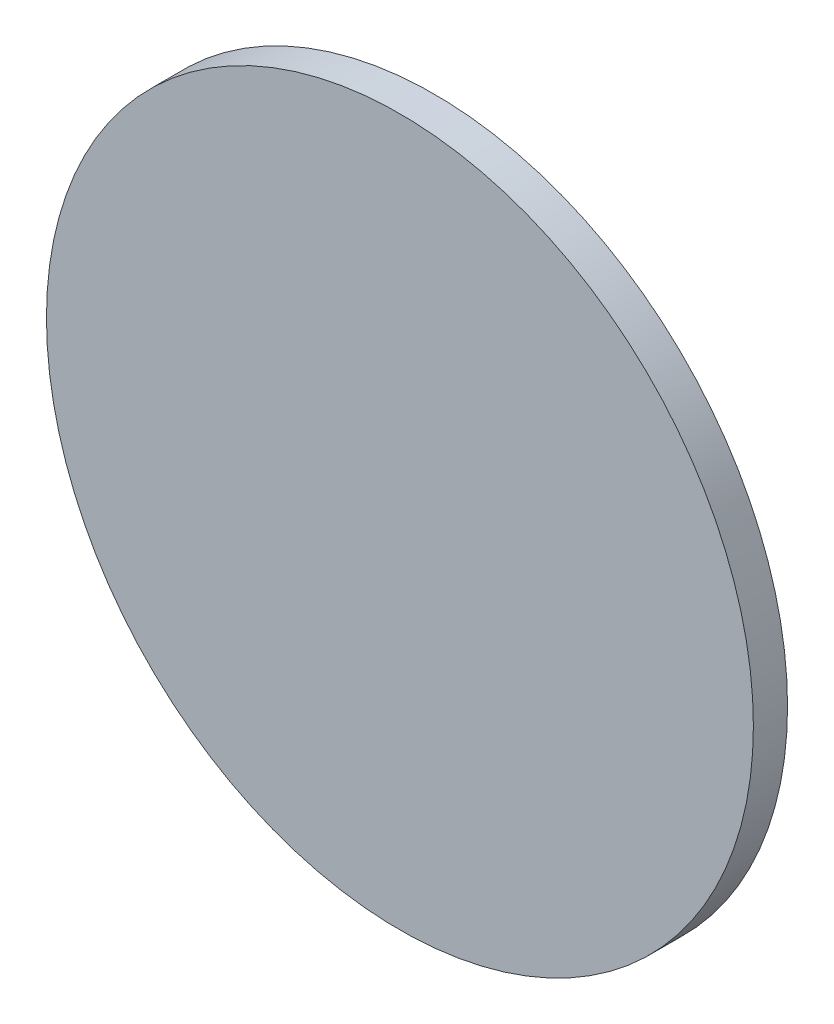
ISO-10303-21;
HEADER;
FILE_DESCRIPTION(('STEP AP214'),'2;1');
FILE_NAME('part.step','',(''),(''),'','','');
FILE_SCHEMA(('AUTOMOTIVE_DESIGN { 1 0 10303 214 1 1 1 1 }'));
ENDSEC;
DATA;
#1=APPLICATION_CONTEXT('core data for automotive mechanical design processes');
#2=APPLICATION_PROTOCOL_DEFINITION('international standard','automotive_design',2000,#1);
#3=PRODUCT_CONTEXT('',#1,'mechanical');
#4=PRODUCT('Part','Part','',(#3));
#5=PRODUCT_RELATED_PRODUCT_CATEGORY('part','',(#4));
#6=PRODUCT_DEFINITION_FORMATION('','',#4);
#7=PRODUCT_DEFINITION_CONTEXT('part definition',#1,'design');
#8=PRODUCT_DEFINITION('design','',#6,#7);
#9=PRODUCT_DEFINITION_SHAPE('','',#8);
#10=(LENGTH_UNIT() NAMED_UNIT(*) SI_UNIT(.MILLI.,.METRE.));
#11=(NAMED_UNIT(*) PLANE_ANGLE_UNIT() SI_UNIT($,.RADIAN.));
#12=(NAMED_UNIT(*) SI_UNIT($,.STERADIAN.) SOLID_ANGLE_UNIT());
#13=UNCERTAINTY_MEASURE_WITH_UNIT(LENGTH_MEASURE(1.E-05),#10,'distance_accuracy_value','');
#14=(GEOMETRIC_REPRESENTATION_CONTEXT(3) GLOBAL_UNCERTAINTY_ASSIGNED_CONTEXT((#13)) GLOBAL_UNIT_ASSIGNED_CONTEXT((#10,
#11,#12)) REPRESENTATION_CONTEXT('',''));
#15=CARTESIAN_POINT('',(0.,0.,0.));
#16=DIRECTION('',(0.,0.,1.));
#17=DIRECTION('',(1.,0.,0.));
#18=AXIS2_PLACEMENT_3D('',#15,#16,#17);
#19=CARTESIAN_POINT('',(0.,0.,12.9));
#20=DIRECTION('',(0.,0.,-1.));
#21=DIRECTION('',(-1.,0.,0.));
#22=AXIS2_PLACEMENT_3D('',#19,#20,#21);
#23=CYLINDRICAL_SURFACE('',#22,133.5);
#24=CARTESIAN_POINT('',(0.,0.,12.9));
#25=DIRECTION('',(0.,0.,1.));
#26=DIRECTION('',(1.,0.,0.));
#27=AXIS2_PLACEMENT_3D('',#24,#25,#26);
#28=CIRCLE('',#27,133.5);
#29=CARTESIAN_POINT('',(133.5,0.,12.9));
#30=VERTEX_POINT('',#29);
#31=EDGE_CURVE('E10',#30,#30,#28,.T.);
#32=ORIENTED_EDGE('',*,*,#31,.F.);
#33=EDGE_LOOP('',(#32));
#34=FACE_BOUND('',#33,.T.);
#35=CARTESIAN_POINT('',(0.,0.,0.));
#36=DIRECTION('',(0.,0.,1.));
#37=DIRECTION('',(1.,0.,0.));
#38=AXIS2_PLACEMENT_3D('',#35,#36,#37);
#39=CIRCLE('',#38,133.5);
#40=CARTESIAN_POINT('',(133.5,0.,0.));
#41=VERTEX_POINT('',#40);
#42=EDGE_CURVE('E35',#41,#41,#39,.T.);
#43=ORIENTED_EDGE('',*,*,#42,.T.);
#44=EDGE_LOOP('',(#43));
#45=FACE_BOUND('',#44,.T.);
#46=ADVANCED_FACE('F32',(#34,#45),#23,.T.);
#47=CARTESIAN_POINT('',(0.,0.,12.9));
#48=DIRECTION('',(0.,0.,1.));
#49=DIRECTION('',(1.,0.,0.));
#50=AXIS2_PLACEMENT_3D('',#47,#48,#49);
#51=PLANE('',#50);
#52=ORIENTED_EDGE('',*,*,#31,.T.);
#53=EDGE_LOOP('',(#52));
#54=FACE_BOUND('',#53,.T.);
#55=ADVANCED_FACE('F47',(#54),#51,.T.);
#56=CARTESIAN_POINT('',(0.,0.,0.));
#57=DIRECTION('',(0.,0.,1.));
#58=DIRECTION('',(1.,0.,0.));
#59=AXIS2_PLACEMENT_3D('',#56,#57,#58);
#60=PLANE('',#59);
#61=ORIENTED_EDGE('',*,*,#42,.F.);
#62=EDGE_LOOP('',(#61));
#63=FACE_BOUND('',#62,.T.);
#64=ADVANCED_FACE('F45',(#63),#60,.F.);
#65=CLOSED_SHELL('',(#46,#55,#64));
#66=MANIFOLD_SOLID_BREP('B2',#65);
#67=ADVANCED_BREP_SHAPE_REPRESENTATION('',(#18,#66),#14);
#68=SHAPE_DEFINITION_REPRESENTATION(#9,#67);
ENDSEC;
END-ISO-10303-21;
